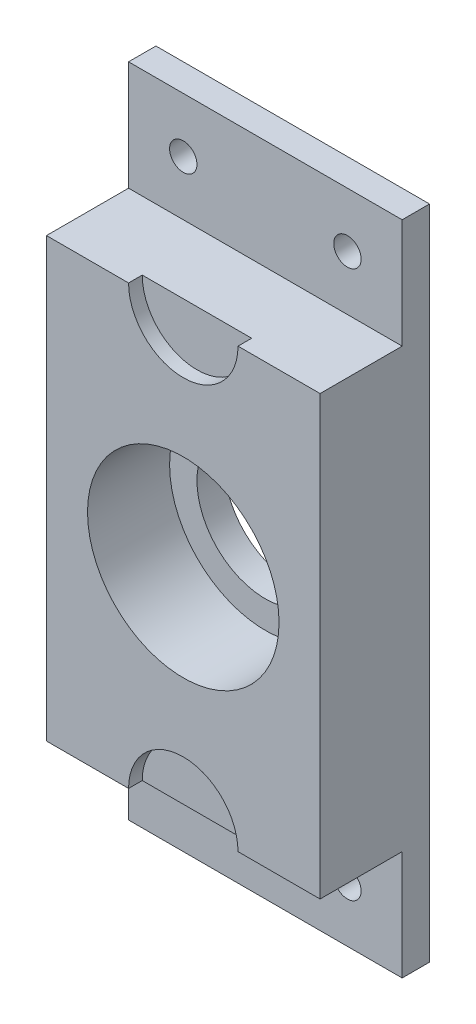
ISO-10303-21;
HEADER;
FILE_DESCRIPTION(('STEP AP214'),'2;1');
FILE_NAME('part.step','',(''),(''),'','','');
FILE_SCHEMA(('AUTOMOTIVE_DESIGN { 1 0 10303 214 1 1 1 1 }'));
ENDSEC;
DATA;
#1=APPLICATION_CONTEXT('core data for automotive mechanical design processes');
#2=APPLICATION_PROTOCOL_DEFINITION('international standard','automotive_design',2000,#1);
#3=PRODUCT_CONTEXT('',#1,'mechanical');
#4=PRODUCT('Part','Part','',(#3));
#5=PRODUCT_RELATED_PRODUCT_CATEGORY('part','',(#4));
#6=PRODUCT_DEFINITION_FORMATION('','',#4);
#7=PRODUCT_DEFINITION_CONTEXT('part definition',#1,'design');
#8=PRODUCT_DEFINITION('design','',#6,#7);
#9=PRODUCT_DEFINITION_SHAPE('','',#8);
#10=(LENGTH_UNIT() NAMED_UNIT(*) SI_UNIT(.MILLI.,.METRE.));
#11=(NAMED_UNIT(*) PLANE_ANGLE_UNIT() SI_UNIT($,.RADIAN.));
#12=(NAMED_UNIT(*) SI_UNIT($,.STERADIAN.) SOLID_ANGLE_UNIT());
#13=UNCERTAINTY_MEASURE_WITH_UNIT(LENGTH_MEASURE(1.E-05),#10,'distance_accuracy_value','');
#14=(GEOMETRIC_REPRESENTATION_CONTEXT(3) GLOBAL_UNCERTAINTY_ASSIGNED_CONTEXT((#13)) GLOBAL_UNIT_ASSIGNED_CONTEXT((#10,
#11,#12)) REPRESENTATION_CONTEXT('',''));
#15=CARTESIAN_POINT('',(0.,0.,0.));
#16=DIRECTION('',(0.,0.,1.));
#17=DIRECTION('',(1.,0.,0.));
#18=AXIS2_PLACEMENT_3D('',#15,#16,#17);
#19=CARTESIAN_POINT('',(0.,0.,25.4));
#20=DIRECTION('',(0.,0.,1.));
#21=DIRECTION('',(1.,0.,0.));
#22=AXIS2_PLACEMENT_3D('',#19,#20,#21);
#23=PLANE('',#22);
#24=CARTESIAN_POINT('',(0.,0.,25.4));
#25=DIRECTION('',(0.,0.,1.));
#26=DIRECTION('',(1.,0.,0.));
#27=AXIS2_PLACEMENT_3D('',#24,#25,#26);
#28=CIRCLE('',#27,22.225);
#29=CARTESIAN_POINT('',(22.225,0.,25.4));
#30=VERTEX_POINT('',#29);
#31=EDGE_CURVE('E292',#30,#30,#28,.T.);
#32=ORIENTED_EDGE('',*,*,#31,.F.);
#33=EDGE_LOOP('',(#32));
#34=FACE_BOUND('',#33,.T.);
#35=DIRECTION('',(1.,0.,0.));
#36=VECTOR('',#35,1.);
#37=CARTESIAN_POINT('',(-31.75,50.8,25.4));
#38=LINE('',#37,#36);
#39=CARTESIAN_POINT('',(12.7,50.8,25.4));
#40=VERTEX_POINT('',#39);
#41=CARTESIAN_POINT('',(31.75,50.8,25.4));
#42=VERTEX_POINT('',#41);
#43=EDGE_CURVE('E148',#40,#42,#38,.T.);
#44=ORIENTED_EDGE('',*,*,#43,.F.);
#45=CARTESIAN_POINT('',(0.,50.8,25.4));
#46=DIRECTION('',(0.,0.,-1.));
#47=DIRECTION('',(-1.,0.,0.));
#48=AXIS2_PLACEMENT_3D('',#45,#46,#47);
#49=CIRCLE('',#48,12.7);
#50=CARTESIAN_POINT('',(-12.7,50.8,25.4));
#51=VERTEX_POINT('',#50);
#52=EDGE_CURVE('E132',#40,#51,#49,.T.);
#53=ORIENTED_EDGE('',*,*,#52,.T.);
#54=CARTESIAN_POINT('',(-31.75,50.8,25.4));
#55=VERTEX_POINT('',#54);
#56=EDGE_CURVE('E145',#55,#51,#38,.T.);
#57=ORIENTED_EDGE('',*,*,#56,.F.);
#58=DIRECTION('',(0.,1.,0.));
#59=VECTOR('',#58,1.);
#60=CARTESIAN_POINT('',(-31.75,0.,25.4));
#61=LINE('',#60,#59);
#62=CARTESIAN_POINT('',(-31.75,-50.8,25.4));
#63=VERTEX_POINT('',#62);
#64=EDGE_CURVE('E219',#63,#55,#61,.T.);
#65=ORIENTED_EDGE('',*,*,#64,.F.);
#66=DIRECTION('',(-1.,0.,0.));
#67=VECTOR('',#66,1.);
#68=CARTESIAN_POINT('',(31.75,-50.8,25.4));
#69=LINE('',#68,#67);
#70=CARTESIAN_POINT('',(-12.7,-50.8,25.4));
#71=VERTEX_POINT('',#70);
#72=EDGE_CURVE('E194',#71,#63,#69,.T.);
#73=ORIENTED_EDGE('',*,*,#72,.F.);
#74=CARTESIAN_POINT('',(0.,-50.8,25.4));
#75=DIRECTION('',(0.,0.,1.));
#76=DIRECTION('',(1.,0.,0.));
#77=AXIS2_PLACEMENT_3D('',#74,#75,#76);
#78=CIRCLE('',#77,12.7);
#79=CARTESIAN_POINT('',(12.7,-50.8,25.4));
#80=VERTEX_POINT('',#79);
#81=EDGE_CURVE('E150',#80,#71,#78,.T.);
#82=ORIENTED_EDGE('',*,*,#81,.F.);
#83=CARTESIAN_POINT('',(31.75,-50.8,25.4));
#84=VERTEX_POINT('',#83);
#85=EDGE_CURVE('E180',#84,#80,#69,.T.);
#86=ORIENTED_EDGE('',*,*,#85,.F.);
#87=DIRECTION('',(0.,1.,0.));
#88=VECTOR('',#87,1.);
#89=CARTESIAN_POINT('',(31.75,0.,25.4));
#90=LINE('',#89,#88);
#91=EDGE_CURVE('E216',#84,#42,#90,.T.);
#92=ORIENTED_EDGE('',*,*,#91,.T.);
#93=EDGE_LOOP('',(#44,#53,#57,#65,#73,#82,#86,#92));
#94=FACE_BOUND('',#93,.T.);
#95=ADVANCED_FACE('F40',(#34,#94),#23,.T.);
#96=CARTESIAN_POINT('',(-31.75,50.8,6.35));
#97=DIRECTION('',(0.,-1.,0.));
#98=DIRECTION('',(0.,0.,-1.));
#99=AXIS2_PLACEMENT_3D('',#96,#97,#98);
#100=PLANE('',#99);
#101=DIRECTION('',(0.,0.,1.));
#102=VECTOR('',#101,1.);
#103=CARTESIAN_POINT('',(12.7,50.8,22.225));
#104=LINE('',#103,#102);
#105=CARTESIAN_POINT('',(12.7,50.8,22.225));
#106=VERTEX_POINT('',#105);
#107=EDGE_CURVE('E138',#40,#106,#104,.F.);
#108=ORIENTED_EDGE('',*,*,#107,.F.);
#109=ORIENTED_EDGE('',*,*,#43,.T.);
#110=DIRECTION('',(0.,0.,1.));
#111=VECTOR('',#110,1.);
#112=CARTESIAN_POINT('',(31.75,50.8,6.35));
#113=LINE('',#112,#111);
#114=CARTESIAN_POINT('',(31.75,50.8,6.35));
#115=VERTEX_POINT('',#114);
#116=EDGE_CURVE('E168',#115,#42,#113,.T.);
#117=ORIENTED_EDGE('',*,*,#116,.F.);
#118=DIRECTION('',(1.,0.,0.));
#119=VECTOR('',#118,1.);
#120=CARTESIAN_POINT('',(-31.75,50.8,6.35));
#121=LINE('',#120,#119);
#122=CARTESIAN_POINT('',(-31.75,50.8,6.35));
#123=VERTEX_POINT('',#122);
#124=EDGE_CURVE('E161',#123,#115,#121,.T.);
#125=ORIENTED_EDGE('',*,*,#124,.F.);
#126=DIRECTION('',(0.,0.,1.));
#127=VECTOR('',#126,1.);
#128=CARTESIAN_POINT('',(-31.75,50.8,6.35));
#129=LINE('',#128,#127);
#130=EDGE_CURVE('E154',#123,#55,#129,.T.);
#131=ORIENTED_EDGE('',*,*,#130,.T.);
#132=ORIENTED_EDGE('',*,*,#56,.T.);
#133=DIRECTION('',(0.,0.,1.));
#134=VECTOR('',#133,1.);
#135=CARTESIAN_POINT('',(-12.7,50.8,22.225));
#136=LINE('',#135,#134);
#137=CARTESIAN_POINT('',(-12.7,50.8,22.225));
#138=VERTEX_POINT('',#137);
#139=EDGE_CURVE('E129',#138,#51,#136,.T.);
#140=ORIENTED_EDGE('',*,*,#139,.F.);
#141=DIRECTION('',(1.,0.,0.));
#142=VECTOR('',#141,1.);
#143=CARTESIAN_POINT('',(-31.75,50.8,22.225));
#144=LINE('',#143,#142);
#145=EDGE_CURVE('E139',#138,#106,#144,.T.);
#146=ORIENTED_EDGE('',*,*,#145,.T.);
#147=EDGE_LOOP('',(#108,#109,#117,#125,#131,#132,#140,#146));
#148=FACE_BOUND('',#147,.T.);
#149=ADVANCED_FACE('F152',(#148),#100,.F.);
#150=CARTESIAN_POINT('',(0.,0.,0.));
#151=DIRECTION('',(0.,0.,1.));
#152=DIRECTION('',(1.,0.,0.));
#153=AXIS2_PLACEMENT_3D('',#150,#151,#152);
#154=CYLINDRICAL_SURFACE('',#153,15.875);
#155=CARTESIAN_POINT('',(0.,0.,0.));
#156=DIRECTION('',(0.,0.,1.));
#157=DIRECTION('',(1.,0.,0.));
#158=AXIS2_PLACEMENT_3D('',#155,#156,#157);
#159=CIRCLE('',#158,15.875);
#160=CARTESIAN_POINT('',(15.875,0.,0.));
#161=VERTEX_POINT('',#160);
#162=EDGE_CURVE('E297',#161,#161,#159,.T.);
#163=ORIENTED_EDGE('',*,*,#162,.F.);
#164=EDGE_LOOP('',(#163));
#165=FACE_BOUND('',#164,.T.);
#166=CARTESIAN_POINT('',(0.,0.,6.35));
#167=DIRECTION('',(0.,0.,1.));
#168=DIRECTION('',(1.,0.,0.));
#169=AXIS2_PLACEMENT_3D('',#166,#167,#168);
#170=CIRCLE('',#169,15.875);
#171=CARTESIAN_POINT('',(15.875,0.,6.35));
#172=VERTEX_POINT('',#171);
#173=EDGE_CURVE('E288',#172,#172,#170,.T.);
#174=ORIENTED_EDGE('',*,*,#173,.T.);
#175=EDGE_LOOP('',(#174));
#176=FACE_BOUND('',#175,.T.);
#177=ADVANCED_FACE('F357',(#165,#176),#154,.F.);
#178=CARTESIAN_POINT('',(0.,-76.2,25.4));
#179=DIRECTION('',(0.,1.,0.));
#180=DIRECTION('',(0.,0.,1.));
#181=AXIS2_PLACEMENT_3D('',#178,#179,#180);
#182=PLANE('',#181);
#183=DIRECTION('',(1.,0.,0.));
#184=VECTOR('',#183,1.);
#185=CARTESIAN_POINT('',(31.75,-76.2,6.35));
#186=LINE('',#185,#184);
#187=CARTESIAN_POINT('',(-31.75,-76.2,6.35));
#188=VERTEX_POINT('',#187);
#189=CARTESIAN_POINT('',(31.75,-76.2,6.35));
#190=VERTEX_POINT('',#189);
#191=EDGE_CURVE('E187',#188,#190,#186,.T.);
#192=ORIENTED_EDGE('',*,*,#191,.F.);
#193=DIRECTION('',(0.,0.,-1.));
#194=VECTOR('',#193,1.);
#195=CARTESIAN_POINT('',(-31.75,-76.2,25.4));
#196=LINE('',#195,#194);
#197=CARTESIAN_POINT('',(-31.75,-76.2,0.));
#198=VERTEX_POINT('',#197);
#199=EDGE_CURVE('E223',#188,#198,#196,.T.);
#200=ORIENTED_EDGE('',*,*,#199,.T.);
#201=DIRECTION('',(1.,0.,0.));
#202=VECTOR('',#201,1.);
#203=CARTESIAN_POINT('',(0.,-76.2,0.));
#204=LINE('',#203,#202);
#205=CARTESIAN_POINT('',(31.75,-76.2,0.));
#206=VERTEX_POINT('',#205);
#207=EDGE_CURVE('E239',#198,#206,#204,.T.);
#208=ORIENTED_EDGE('',*,*,#207,.T.);
#209=DIRECTION('',(0.,0.,-1.));
#210=VECTOR('',#209,1.);
#211=CARTESIAN_POINT('',(31.75,-76.2,25.4));
#212=LINE('',#211,#210);
#213=EDGE_CURVE('E262',#190,#206,#212,.T.);
#214=ORIENTED_EDGE('',*,*,#213,.F.);
#215=EDGE_LOOP('',(#192,#200,#208,#214));
#216=FACE_BOUND('',#215,.T.);
#217=ADVANCED_FACE('F330',(#216),#182,.F.);
#218=CARTESIAN_POINT('',(0.,76.2,25.4));
#219=DIRECTION('',(0.,1.,0.));
#220=DIRECTION('',(0.,0.,1.));
#221=AXIS2_PLACEMENT_3D('',#218,#219,#220);
#222=PLANE('',#221);
#223=DIRECTION('',(0.,0.,-1.));
#224=VECTOR('',#223,1.);
#225=CARTESIAN_POINT('',(-31.75,76.2,25.4));
#226=LINE('',#225,#224);
#227=CARTESIAN_POINT('',(-31.75,76.2,6.35));
#228=VERTEX_POINT('',#227);
#229=CARTESIAN_POINT('',(-31.75,76.2,0.));
#230=VERTEX_POINT('',#229);
#231=EDGE_CURVE('E256',#228,#230,#226,.T.);
#232=ORIENTED_EDGE('',*,*,#231,.F.);
#233=DIRECTION('',(-1.,0.,0.));
#234=VECTOR('',#233,1.);
#235=CARTESIAN_POINT('',(-31.75,76.2,6.35));
#236=LINE('',#235,#234);
#237=CARTESIAN_POINT('',(31.75,76.2,6.35));
#238=VERTEX_POINT('',#237);
#239=EDGE_CURVE('E166',#238,#228,#236,.T.);
#240=ORIENTED_EDGE('',*,*,#239,.F.);
#241=DIRECTION('',(0.,0.,-1.));
#242=VECTOR('',#241,1.);
#243=CARTESIAN_POINT('',(31.75,76.2,25.4));
#244=LINE('',#243,#242);
#245=CARTESIAN_POINT('',(31.75,76.2,0.));
#246=VERTEX_POINT('',#245);
#247=EDGE_CURVE('E259',#238,#246,#244,.T.);
#248=ORIENTED_EDGE('',*,*,#247,.T.);
#249=DIRECTION('',(1.,0.,0.));
#250=VECTOR('',#249,1.);
#251=CARTESIAN_POINT('',(0.,76.2,0.));
#252=LINE('',#251,#250);
#253=EDGE_CURVE('E247',#230,#246,#252,.T.);
#254=ORIENTED_EDGE('',*,*,#253,.F.);
#255=EDGE_LOOP('',(#232,#240,#248,#254));
#256=FACE_BOUND('',#255,.T.);
#257=ADVANCED_FACE('F321',(#256),#222,.T.);
#258=CARTESIAN_POINT('',(-19.05,-63.5,25.4));
#259=DIRECTION('',(0.,0.,-1.));
#260=DIRECTION('',(-1.,0.,0.));
#261=AXIS2_PLACEMENT_3D('',#258,#259,#260);
#262=CYLINDRICAL_SURFACE('',#261,3.175);
#263=CARTESIAN_POINT('',(-19.05,-63.5,0.));
#264=DIRECTION('',(0.,0.,1.));
#265=DIRECTION('',(1.,0.,0.));
#266=AXIS2_PLACEMENT_3D('',#263,#264,#265);
#267=CIRCLE('',#266,3.175);
#268=CARTESIAN_POINT('',(-15.875,-63.5,0.));
#269=VERTEX_POINT('',#268);
#270=EDGE_CURVE('E235',#269,#269,#267,.T.);
#271=ORIENTED_EDGE('',*,*,#270,.F.);
#272=EDGE_LOOP('',(#271));
#273=FACE_BOUND('',#272,.T.);
#274=CARTESIAN_POINT('',(-19.05,-63.5,6.35));
#275=DIRECTION('',(0.,0.,1.));
#276=DIRECTION('',(1.,0.,0.));
#277=AXIS2_PLACEMENT_3D('',#274,#275,#276);
#278=CIRCLE('',#277,3.175);
#279=CARTESIAN_POINT('',(-15.875,-63.5,6.35));
#280=VERTEX_POINT('',#279);
#281=EDGE_CURVE('E203',#280,#280,#278,.T.);
#282=ORIENTED_EDGE('',*,*,#281,.T.);
#283=EDGE_LOOP('',(#282));
#284=FACE_BOUND('',#283,.T.);
#285=ADVANCED_FACE('F370',(#273,#284),#262,.F.);
#286=CARTESIAN_POINT('',(-19.05,63.5,25.4));
#287=DIRECTION('',(0.,0.,-1.));
#288=DIRECTION('',(-1.,0.,0.));
#289=AXIS2_PLACEMENT_3D('',#286,#287,#288);
#290=CYLINDRICAL_SURFACE('',#289,3.175);
#291=CARTESIAN_POINT('',(-19.05,63.5,0.));
#292=DIRECTION('',(0.,0.,1.));
#293=DIRECTION('',(1.,0.,0.));
#294=AXIS2_PLACEMENT_3D('',#291,#292,#293);
#295=CIRCLE('',#294,3.175);
#296=CARTESIAN_POINT('',(-15.875,63.5,0.));
#297=VERTEX_POINT('',#296);
#298=EDGE_CURVE('E231',#297,#297,#295,.T.);
#299=ORIENTED_EDGE('',*,*,#298,.F.);
#300=EDGE_LOOP('',(#299));
#301=FACE_BOUND('',#300,.T.);
#302=CARTESIAN_POINT('',(-19.05,63.5,6.35));
#303=DIRECTION('',(0.,0.,1.));
#304=DIRECTION('',(1.,0.,0.));
#305=AXIS2_PLACEMENT_3D('',#302,#303,#304);
#306=CIRCLE('',#305,3.175);
#307=CARTESIAN_POINT('',(-15.875,63.5,6.35));
#308=VERTEX_POINT('',#307);
#309=EDGE_CURVE('E211',#308,#308,#306,.T.);
#310=ORIENTED_EDGE('',*,*,#309,.T.);
#311=EDGE_LOOP('',(#310));
#312=FACE_BOUND('',#311,.T.);
#313=ADVANCED_FACE('F377',(#301,#312),#290,.F.);
#314=CARTESIAN_POINT('',(19.05,63.5,25.4));
#315=DIRECTION('',(0.,0.,-1.));
#316=DIRECTION('',(-1.,0.,0.));
#317=AXIS2_PLACEMENT_3D('',#314,#315,#316);
#318=CYLINDRICAL_SURFACE('',#317,3.175);
#319=CARTESIAN_POINT('',(19.05,63.5,0.));
#320=DIRECTION('',(0.,0.,1.));
#321=DIRECTION('',(1.,0.,0.));
#322=AXIS2_PLACEMENT_3D('',#319,#320,#321);
#323=CIRCLE('',#322,3.175);
#324=CARTESIAN_POINT('',(22.225,63.5,0.));
#325=VERTEX_POINT('',#324);
#326=EDGE_CURVE('E227',#325,#325,#323,.T.);
#327=ORIENTED_EDGE('',*,*,#326,.F.);
#328=EDGE_LOOP('',(#327));
#329=FACE_BOUND('',#328,.T.);
#330=CARTESIAN_POINT('',(19.05,63.5,6.35));
#331=DIRECTION('',(0.,0.,1.));
#332=DIRECTION('',(1.,0.,0.));
#333=AXIS2_PLACEMENT_3D('',#330,#331,#332);
#334=CIRCLE('',#333,3.175);
#335=CARTESIAN_POINT('',(22.225,63.5,6.35));
#336=VERTEX_POINT('',#335);
#337=EDGE_CURVE('E207',#336,#336,#334,.T.);
#338=ORIENTED_EDGE('',*,*,#337,.T.);
#339=EDGE_LOOP('',(#338));
#340=FACE_BOUND('',#339,.T.);
#341=ADVANCED_FACE('F380',(#329,#340),#318,.F.);
#342=CARTESIAN_POINT('',(19.05,-63.5,25.4));
#343=DIRECTION('',(0.,0.,-1.));
#344=DIRECTION('',(-1.,0.,0.));
#345=AXIS2_PLACEMENT_3D('',#342,#343,#344);
#346=CYLINDRICAL_SURFACE('',#345,3.175);
#347=CARTESIAN_POINT('',(19.05,-63.5,0.));
#348=DIRECTION('',(0.,0.,1.));
#349=DIRECTION('',(1.,0.,0.));
#350=AXIS2_PLACEMENT_3D('',#347,#348,#349);
#351=CIRCLE('',#350,3.175);
#352=CARTESIAN_POINT('',(22.225,-63.5,0.));
#353=VERTEX_POINT('',#352);
#354=EDGE_CURVE('E215',#353,#353,#351,.T.);
#355=ORIENTED_EDGE('',*,*,#354,.F.);
#356=EDGE_LOOP('',(#355));
#357=FACE_BOUND('',#356,.T.);
#358=CARTESIAN_POINT('',(19.05,-63.5,6.35));
#359=DIRECTION('',(0.,0.,1.));
#360=DIRECTION('',(1.,0.,0.));
#361=AXIS2_PLACEMENT_3D('',#358,#359,#360);
#362=CIRCLE('',#361,3.175);
#363=CARTESIAN_POINT('',(22.225,-63.5,6.35));
#364=VERTEX_POINT('',#363);
#365=EDGE_CURVE('E172',#364,#364,#362,.T.);
#366=ORIENTED_EDGE('',*,*,#365,.T.);
#367=EDGE_LOOP('',(#366));
#368=FACE_BOUND('',#367,.T.);
#369=ADVANCED_FACE('F42',(#357,#368),#346,.F.);
#370=CARTESIAN_POINT('',(31.75,0.,25.4));
#371=DIRECTION('',(-1.,0.,0.));
#372=DIRECTION('',(0.,0.,1.));
#373=AXIS2_PLACEMENT_3D('',#370,#371,#372);
#374=PLANE('',#373);
#375=DIRECTION('',(0.,1.,0.));
#376=VECTOR('',#375,1.);
#377=CARTESIAN_POINT('',(31.75,76.2,6.35));
#378=LINE('',#377,#376);
#379=EDGE_CURVE('E306',#115,#238,#378,.T.);
#380=ORIENTED_EDGE('',*,*,#379,.F.);
#381=ORIENTED_EDGE('',*,*,#116,.T.);
#382=ORIENTED_EDGE('',*,*,#91,.F.);
#383=DIRECTION('',(0.,0.,1.));
#384=VECTOR('',#383,1.);
#385=CARTESIAN_POINT('',(31.75,-50.8,6.35));
#386=LINE('',#385,#384);
#387=CARTESIAN_POINT('',(31.75,-50.8,6.35));
#388=VERTEX_POINT('',#387);
#389=EDGE_CURVE('E190',#388,#84,#386,.T.);
#390=ORIENTED_EDGE('',*,*,#389,.F.);
#391=DIRECTION('',(0.,1.,0.));
#392=VECTOR('',#391,1.);
#393=CARTESIAN_POINT('',(31.75,-76.2,6.35));
#394=LINE('',#393,#392);
#395=EDGE_CURVE('E175',#190,#388,#394,.T.);
#396=ORIENTED_EDGE('',*,*,#395,.F.);
#397=ORIENTED_EDGE('',*,*,#213,.T.);
#398=DIRECTION('',(0.,1.,0.));
#399=VECTOR('',#398,1.);
#400=CARTESIAN_POINT('',(31.75,0.,0.));
#401=LINE('',#400,#399);
#402=EDGE_CURVE('E243',#206,#246,#401,.T.);
#403=ORIENTED_EDGE('',*,*,#402,.T.);
#404=ORIENTED_EDGE('',*,*,#247,.F.);
#405=EDGE_LOOP('',(#380,#381,#382,#390,#396,#397,#403,#404));
#406=FACE_BOUND('',#405,.T.);
#407=ADVANCED_FACE('F337',(#406),#374,.F.);
#408=CARTESIAN_POINT('',(-31.75,0.,25.4));
#409=DIRECTION('',(-1.,0.,0.));
#410=DIRECTION('',(0.,0.,1.));
#411=AXIS2_PLACEMENT_3D('',#408,#409,#410);
#412=PLANE('',#411);
#413=ORIENTED_EDGE('',*,*,#130,.F.);
#414=DIRECTION('',(0.,-1.,0.));
#415=VECTOR('',#414,1.);
#416=CARTESIAN_POINT('',(-31.75,76.2,6.35));
#417=LINE('',#416,#415);
#418=EDGE_CURVE('E156',#228,#123,#417,.T.);
#419=ORIENTED_EDGE('',*,*,#418,.F.);
#420=ORIENTED_EDGE('',*,*,#231,.T.);
#421=DIRECTION('',(0.,1.,0.));
#422=VECTOR('',#421,1.);
#423=CARTESIAN_POINT('',(-31.75,0.,0.));
#424=LINE('',#423,#422);
#425=EDGE_CURVE('E220',#198,#230,#424,.T.);
#426=ORIENTED_EDGE('',*,*,#425,.F.);
#427=ORIENTED_EDGE('',*,*,#199,.F.);
#428=DIRECTION('',(0.,-1.,0.));
#429=VECTOR('',#428,1.);
#430=CARTESIAN_POINT('',(-31.75,-76.2,6.35));
#431=LINE('',#430,#429);
#432=CARTESIAN_POINT('',(-31.75,-50.8,6.35));
#433=VERTEX_POINT('',#432);
#434=EDGE_CURVE('E184',#433,#188,#431,.T.);
#435=ORIENTED_EDGE('',*,*,#434,.F.);
#436=DIRECTION('',(0.,0.,1.));
#437=VECTOR('',#436,1.);
#438=CARTESIAN_POINT('',(-31.75,-50.8,6.35));
#439=LINE('',#438,#437);
#440=EDGE_CURVE('E163',#433,#63,#439,.T.);
#441=ORIENTED_EDGE('',*,*,#440,.T.);
#442=ORIENTED_EDGE('',*,*,#64,.T.);
#443=EDGE_LOOP('',(#413,#419,#420,#426,#427,#435,#441,#442));
#444=FACE_BOUND('',#443,.T.);
#445=ADVANCED_FACE('F318',(#444),#412,.T.);
#446=CARTESIAN_POINT('',(0.,0.,0.));
#447=DIRECTION('',(0.,0.,1.));
#448=DIRECTION('',(1.,0.,0.));
#449=AXIS2_PLACEMENT_3D('',#446,#447,#448);
#450=PLANE('',#449);
#451=ORIENTED_EDGE('',*,*,#162,.T.);
#452=EDGE_LOOP('',(#451));
#453=FACE_BOUND('',#452,.T.);
#454=ORIENTED_EDGE('',*,*,#354,.T.);
#455=EDGE_LOOP('',(#454));
#456=FACE_BOUND('',#455,.T.);
#457=ORIENTED_EDGE('',*,*,#326,.T.);
#458=EDGE_LOOP('',(#457));
#459=FACE_BOUND('',#458,.T.);
#460=ORIENTED_EDGE('',*,*,#298,.T.);
#461=EDGE_LOOP('',(#460));
#462=FACE_BOUND('',#461,.T.);
#463=ORIENTED_EDGE('',*,*,#270,.T.);
#464=EDGE_LOOP('',(#463));
#465=FACE_BOUND('',#464,.T.);
#466=ORIENTED_EDGE('',*,*,#207,.F.);
#467=ORIENTED_EDGE('',*,*,#425,.T.);
#468=ORIENTED_EDGE('',*,*,#253,.T.);
#469=ORIENTED_EDGE('',*,*,#402,.F.);
#470=EDGE_LOOP('',(#466,#467,#468,#469));
#471=FACE_BOUND('',#470,.T.);
#472=ADVANCED_FACE('F325',(#453,#456,#459,#462,#465,#471),#450,.F.);
#473=CARTESIAN_POINT('',(31.75,-50.8,6.35));
#474=DIRECTION('',(0.,1.,0.));
#475=DIRECTION('',(0.,0.,1.));
#476=AXIS2_PLACEMENT_3D('',#473,#474,#475);
#477=PLANE('',#476);
#478=DIRECTION('',(1.,0.,0.));
#479=VECTOR('',#478,1.);
#480=CARTESIAN_POINT('',(31.75,-50.8,22.225));
#481=LINE('',#480,#479);
#482=CARTESIAN_POINT('',(-12.7,-50.8,22.225));
#483=VERTEX_POINT('',#482);
#484=CARTESIAN_POINT('',(12.7,-50.8,22.225));
#485=VERTEX_POINT('',#484);
#486=EDGE_CURVE('E269',#483,#485,#481,.T.);
#487=ORIENTED_EDGE('',*,*,#486,.F.);
#488=DIRECTION('',(0.,0.,1.));
#489=VECTOR('',#488,1.);
#490=CARTESIAN_POINT('',(-12.7,-50.8,22.225));
#491=LINE('',#490,#489);
#492=EDGE_CURVE('E11',#483,#71,#491,.T.);
#493=ORIENTED_EDGE('',*,*,#492,.T.);
#494=ORIENTED_EDGE('',*,*,#72,.T.);
#495=ORIENTED_EDGE('',*,*,#440,.F.);
#496=DIRECTION('',(-1.,0.,0.));
#497=VECTOR('',#496,1.);
#498=CARTESIAN_POINT('',(31.75,-50.8,6.35));
#499=LINE('',#498,#497);
#500=EDGE_CURVE('E179',#388,#433,#499,.T.);
#501=ORIENTED_EDGE('',*,*,#500,.F.);
#502=ORIENTED_EDGE('',*,*,#389,.T.);
#503=ORIENTED_EDGE('',*,*,#85,.T.);
#504=DIRECTION('',(0.,0.,1.));
#505=VECTOR('',#504,1.);
#506=CARTESIAN_POINT('',(12.7,-50.8,22.225));
#507=LINE('',#506,#505);
#508=EDGE_CURVE('E49',#80,#485,#507,.F.);
#509=ORIENTED_EDGE('',*,*,#508,.T.);
#510=EDGE_LOOP('',(#487,#493,#494,#495,#501,#502,#503,#509));
#511=FACE_BOUND('',#510,.T.);
#512=ADVANCED_FACE('F275',(#511),#477,.F.);
#513=CARTESIAN_POINT('',(0.,0.,6.35));
#514=DIRECTION('',(0.,0.,1.));
#515=DIRECTION('',(1.,0.,0.));
#516=AXIS2_PLACEMENT_3D('',#513,#514,#515);
#517=PLANE('',#516);
#518=ORIENTED_EDGE('',*,*,#281,.F.);
#519=EDGE_LOOP('',(#518));
#520=FACE_BOUND('',#519,.T.);
#521=ORIENTED_EDGE('',*,*,#365,.F.);
#522=EDGE_LOOP('',(#521));
#523=FACE_BOUND('',#522,.T.);
#524=ORIENTED_EDGE('',*,*,#395,.T.);
#525=ORIENTED_EDGE('',*,*,#500,.T.);
#526=ORIENTED_EDGE('',*,*,#434,.T.);
#527=ORIENTED_EDGE('',*,*,#191,.T.);
#528=EDGE_LOOP('',(#524,#525,#526,#527));
#529=FACE_BOUND('',#528,.T.);
#530=ADVANCED_FACE('F334',(#520,#523,#529),#517,.T.);
#531=CARTESIAN_POINT('',(0.,0.,6.35));
#532=DIRECTION('',(0.,0.,1.));
#533=DIRECTION('',(1.,0.,0.));
#534=AXIS2_PLACEMENT_3D('',#531,#532,#533);
#535=PLANE('',#534);
#536=ORIENTED_EDGE('',*,*,#309,.F.);
#537=EDGE_LOOP('',(#536));
#538=FACE_BOUND('',#537,.T.);
#539=ORIENTED_EDGE('',*,*,#337,.F.);
#540=EDGE_LOOP('',(#539));
#541=FACE_BOUND('',#540,.T.);
#542=ORIENTED_EDGE('',*,*,#418,.T.);
#543=ORIENTED_EDGE('',*,*,#124,.T.);
#544=ORIENTED_EDGE('',*,*,#379,.T.);
#545=ORIENTED_EDGE('',*,*,#239,.T.);
#546=EDGE_LOOP('',(#542,#543,#544,#545));
#547=FACE_BOUND('',#546,.T.);
#548=ADVANCED_FACE('F313',(#538,#541,#547),#535,.T.);
#549=CARTESIAN_POINT('',(0.,0.,6.35));
#550=DIRECTION('',(0.,0.,1.));
#551=DIRECTION('',(1.,0.,0.));
#552=AXIS2_PLACEMENT_3D('',#549,#550,#551);
#553=CYLINDRICAL_SURFACE('',#552,22.225);
#554=CARTESIAN_POINT('',(0.,0.,6.35));
#555=DIRECTION('',(0.,0.,1.));
#556=DIRECTION('',(1.,0.,0.));
#557=AXIS2_PLACEMENT_3D('',#554,#555,#556);
#558=CIRCLE('',#557,22.225);
#559=CARTESIAN_POINT('',(22.225,0.,6.35));
#560=VERTEX_POINT('',#559);
#561=EDGE_CURVE('E293',#560,#560,#558,.T.);
#562=ORIENTED_EDGE('',*,*,#561,.F.);
#563=EDGE_LOOP('',(#562));
#564=FACE_BOUND('',#563,.T.);
#565=ORIENTED_EDGE('',*,*,#31,.T.);
#566=EDGE_LOOP('',(#565));
#567=FACE_BOUND('',#566,.T.);
#568=ADVANCED_FACE('F393',(#564,#567),#553,.F.);
#569=CARTESIAN_POINT('',(0.,0.,6.35));
#570=DIRECTION('',(0.,0.,1.));
#571=DIRECTION('',(1.,0.,0.));
#572=AXIS2_PLACEMENT_3D('',#569,#570,#571);
#573=PLANE('',#572);
#574=ORIENTED_EDGE('',*,*,#173,.F.);
#575=EDGE_LOOP('',(#574));
#576=FACE_BOUND('',#575,.T.);
#577=ORIENTED_EDGE('',*,*,#561,.T.);
#578=EDGE_LOOP('',(#577));
#579=FACE_BOUND('',#578,.T.);
#580=ADVANCED_FACE('F349',(#576,#579),#573,.T.);
#581=CARTESIAN_POINT('',(0.,50.8,22.225));
#582=DIRECTION('',(0.,0.,1.));
#583=DIRECTION('',(1.,0.,0.));
#584=AXIS2_PLACEMENT_3D('',#581,#582,#583);
#585=CYLINDRICAL_SURFACE('',#584,12.7);
#586=ORIENTED_EDGE('',*,*,#107,.T.);
#587=CARTESIAN_POINT('',(0.,50.8,22.225));
#588=DIRECTION('',(0.,0.,-1.));
#589=DIRECTION('',(-1.,0.,0.));
#590=AXIS2_PLACEMENT_3D('',#587,#588,#589);
#591=CIRCLE('',#590,12.7);
#592=EDGE_CURVE('E62',#106,#138,#591,.T.);
#593=ORIENTED_EDGE('',*,*,#592,.T.);
#594=ORIENTED_EDGE('',*,*,#139,.T.);
#595=ORIENTED_EDGE('',*,*,#52,.F.);
#596=EDGE_LOOP('',(#586,#593,#594,#595));
#597=FACE_BOUND('',#596,.T.);
#598=ADVANCED_FACE('F131',(#597),#585,.F.);
#599=CARTESIAN_POINT('',(0.,50.8,22.225));
#600=DIRECTION('',(0.,0.,-1.));
#601=DIRECTION('',(-1.,0.,0.));
#602=AXIS2_PLACEMENT_3D('',#599,#600,#601);
#603=PLANE('',#602);
#604=ORIENTED_EDGE('',*,*,#592,.F.);
#605=ORIENTED_EDGE('',*,*,#145,.F.);
#606=EDGE_LOOP('',(#604,#605));
#607=FACE_BOUND('',#606,.T.);
#608=ADVANCED_FACE('F340',(#607),#603,.F.);
#609=CARTESIAN_POINT('',(0.,-50.8,22.225));
#610=DIRECTION('',(0.,0.,1.));
#611=DIRECTION('',(1.,0.,0.));
#612=AXIS2_PLACEMENT_3D('',#609,#610,#611);
#613=CYLINDRICAL_SURFACE('',#612,12.7);
#614=CARTESIAN_POINT('',(0.,-50.8,22.225));
#615=DIRECTION('',(0.,0.,1.));
#616=DIRECTION('',(1.,0.,0.));
#617=AXIS2_PLACEMENT_3D('',#614,#615,#616);
#618=CIRCLE('',#617,12.7);
#619=EDGE_CURVE('E55',#485,#483,#618,.T.);
#620=ORIENTED_EDGE('',*,*,#619,.F.);
#621=ORIENTED_EDGE('',*,*,#508,.F.);
#622=ORIENTED_EDGE('',*,*,#81,.T.);
#623=ORIENTED_EDGE('',*,*,#492,.F.);
#624=EDGE_LOOP('',(#620,#621,#622,#623));
#625=FACE_BOUND('',#624,.T.);
#626=ADVANCED_FACE('F279',(#625),#613,.F.);
#627=CARTESIAN_POINT('',(0.,-50.8,22.225));
#628=DIRECTION('',(0.,0.,1.));
#629=DIRECTION('',(1.,0.,0.));
#630=AXIS2_PLACEMENT_3D('',#627,#628,#629);
#631=PLANE('',#630);
#632=ORIENTED_EDGE('',*,*,#486,.T.);
#633=ORIENTED_EDGE('',*,*,#619,.T.);
#634=EDGE_LOOP('',(#632,#633));
#635=FACE_BOUND('',#634,.T.);
#636=ADVANCED_FACE('F347',(#635),#631,.T.);
#637=CLOSED_SHELL('',(#95,#149,#177,#217,#257,#285,#313,#341,#369,#407,#445,#472,#512,#530,#548,
#568,#580,#598,#608,#626,#636));
#638=MANIFOLD_SOLID_BREP('B2',#637);
#639=ADVANCED_BREP_SHAPE_REPRESENTATION('',(#18,#638),#14);
#640=SHAPE_DEFINITION_REPRESENTATION(#9,#639);
ENDSEC;
END-ISO-10303-21;
